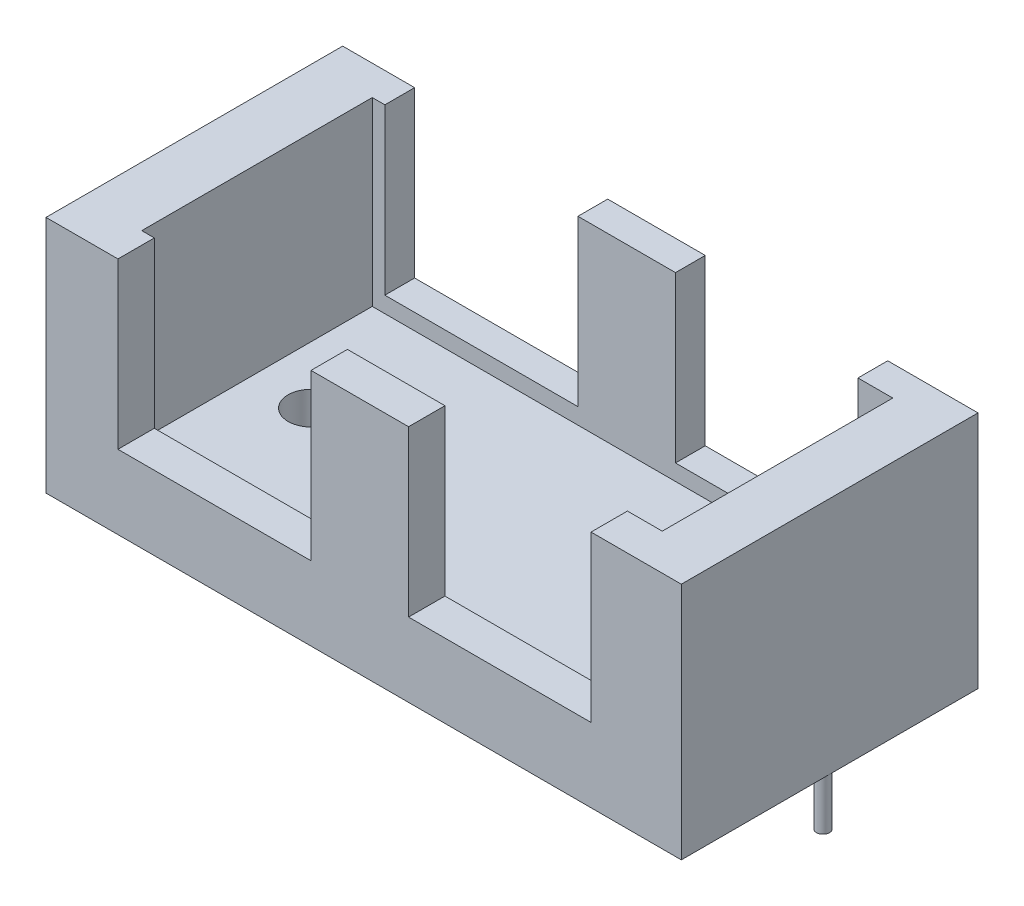
ISO-10303-21;
HEADER;
FILE_DESCRIPTION(('STEP AP214'),'2;1');
FILE_NAME('part.step','',(''),(''),'','','');
FILE_SCHEMA(('AUTOMOTIVE_DESIGN { 1 0 10303 214 1 1 1 1 }'));
ENDSEC;
DATA;
#1=APPLICATION_CONTEXT('core data for automotive mechanical design processes');
#2=APPLICATION_PROTOCOL_DEFINITION('international standard','automotive_design',2000,#1);
#3=PRODUCT_CONTEXT('',#1,'mechanical');
#4=PRODUCT('Part','Part','',(#3));
#5=PRODUCT_RELATED_PRODUCT_CATEGORY('part','',(#4));
#6=PRODUCT_DEFINITION_FORMATION('','',#4);
#7=PRODUCT_DEFINITION_CONTEXT('part definition',#1,'design');
#8=PRODUCT_DEFINITION('design','',#6,#7);
#9=PRODUCT_DEFINITION_SHAPE('','',#8);
#10=(LENGTH_UNIT() NAMED_UNIT(*) SI_UNIT(.MILLI.,.METRE.));
#11=(NAMED_UNIT(*) PLANE_ANGLE_UNIT() SI_UNIT($,.RADIAN.));
#12=(NAMED_UNIT(*) SI_UNIT($,.STERADIAN.) SOLID_ANGLE_UNIT());
#13=UNCERTAINTY_MEASURE_WITH_UNIT(LENGTH_MEASURE(1.E-05),#10,'distance_accuracy_value','');
#14=(GEOMETRIC_REPRESENTATION_CONTEXT(3) GLOBAL_UNCERTAINTY_ASSIGNED_CONTEXT((#13)) GLOBAL_UNIT_ASSIGNED_CONTEXT((#10,
#11,#12)) REPRESENTATION_CONTEXT('',''));
#15=CARTESIAN_POINT('',(0.,0.,0.));
#16=DIRECTION('',(0.,0.,1.));
#17=DIRECTION('',(1.,0.,0.));
#18=AXIS2_PLACEMENT_3D('',#15,#16,#17);
#19=CARTESIAN_POINT('',(0.,16.5,0.));
#20=DIRECTION('',(0.,1.,0.));
#21=DIRECTION('',(0.,0.,1.));
#22=AXIS2_PLACEMENT_3D('',#19,#20,#21);
#23=PLANE('',#22);
#24=DIRECTION('',(0.,0.,-1.));
#25=VECTOR('',#24,1.);
#26=CARTESIAN_POINT('',(14.9871221949098,16.5,0.));
#27=LINE('',#26,#25);
#28=CARTESIAN_POINT('',(14.9871221949098,16.5,11.285141509434));
#29=VERTEX_POINT('',#28);
#30=CARTESIAN_POINT('',(14.9871221949098,16.5,8.77091300304755));
#31=VERTEX_POINT('',#30);
#32=EDGE_CURVE('E278',#29,#31,#27,.T.);
#33=ORIENTED_EDGE('',*,*,#32,.F.);
#34=DIRECTION('',(1.,0.,0.));
#35=VECTOR('',#34,1.);
#36=CARTESIAN_POINT('',(-22.6747641509434,16.5,11.285141509434));
#37=LINE('',#36,#35);
#38=CARTESIAN_POINT('',(21.2252358490566,16.5,11.285141509434));
#39=VERTEX_POINT('',#38);
#40=EDGE_CURVE('E336',#29,#39,#37,.T.);
#41=ORIENTED_EDGE('',*,*,#40,.T.);
#42=DIRECTION('',(0.,0.,-1.));
#43=VECTOR('',#42,1.);
#44=CARTESIAN_POINT('',(21.2252358490566,16.5,-9.21485849056604));
#45=LINE('',#44,#43);
#46=CARTESIAN_POINT('',(21.2252358490566,16.5,-9.21485849056604));
#47=VERTEX_POINT('',#46);
#48=EDGE_CURVE('E341',#39,#47,#45,.T.);
#49=ORIENTED_EDGE('',*,*,#48,.T.);
#50=DIRECTION('',(-1.,0.,0.));
#51=VECTOR('',#50,1.);
#52=CARTESIAN_POINT('',(-22.6747641509434,16.5,-9.21485849056604));
#53=LINE('',#52,#51);
#54=CARTESIAN_POINT('',(14.9871221949098,16.5,-9.21485849056604));
#55=VERTEX_POINT('',#54);
#56=EDGE_CURVE('E345',#47,#55,#53,.T.);
#57=ORIENTED_EDGE('',*,*,#56,.T.);
#58=CARTESIAN_POINT('',(14.9871221949098,16.5,-7.15898780975976));
#59=VERTEX_POINT('',#58);
#60=EDGE_CURVE('E199',#59,#55,#27,.T.);
#61=ORIENTED_EDGE('',*,*,#60,.F.);
#62=DIRECTION('',(-1.,0.,0.));
#63=VECTOR('',#62,1.);
#64=CARTESIAN_POINT('',(17.3921842437679,16.5,-7.15898780975976));
#65=LINE('',#64,#63);
#66=CARTESIAN_POINT('',(17.3921842437679,16.5,-7.15898780975976));
#67=VERTEX_POINT('',#66);
#68=EDGE_CURVE('E301',#67,#59,#65,.T.);
#69=ORIENTED_EDGE('',*,*,#68,.F.);
#70=DIRECTION('',(0.,0.,-1.));
#71=VECTOR('',#70,1.);
#72=CARTESIAN_POINT('',(17.3921842437679,16.5,8.77091300304755));
#73=LINE('',#72,#71);
#74=CARTESIAN_POINT('',(17.3921842437679,16.5,8.77091300304755));
#75=VERTEX_POINT('',#74);
#76=EDGE_CURVE('E284',#75,#67,#73,.T.);
#77=ORIENTED_EDGE('',*,*,#76,.F.);
#78=DIRECTION('',(1.,0.,0.));
#79=VECTOR('',#78,1.);
#80=CARTESIAN_POINT('',(17.3921842437679,16.5,8.77091300304755));
#81=LINE('',#80,#79);
#82=EDGE_CURVE('E308',#31,#75,#81,.T.);
#83=ORIENTED_EDGE('',*,*,#82,.F.);
#84=EDGE_LOOP('',(#33,#41,#49,#57,#61,#69,#77,#83));
#85=FACE_BOUND('',#84,.T.);
#86=ADVANCED_FACE('F32',(#85),#23,.T.);
#87=DIRECTION('',(0.,0.,1.));
#88=VECTOR('',#87,1.);
#89=CARTESIAN_POINT('',(2.37842735237592,16.5,0.));
#90=LINE('',#89,#88);
#91=CARTESIAN_POINT('',(2.37842735237592,16.5,-9.21485849056604));
#92=VERTEX_POINT('',#91);
#93=CARTESIAN_POINT('',(2.37842735237592,16.5,-7.15898780975976));
#94=VERTEX_POINT('',#93);
#95=EDGE_CURVE('E267',#92,#94,#90,.T.);
#96=ORIENTED_EDGE('',*,*,#95,.F.);
#97=CARTESIAN_POINT('',(-4.36227438756731,16.5,-9.21485849056604));
#98=VERTEX_POINT('',#97);
#99=EDGE_CURVE('E348',#92,#98,#53,.T.);
#100=ORIENTED_EDGE('',*,*,#99,.T.);
#101=DIRECTION('',(0.,0.,-1.));
#102=VECTOR('',#101,1.);
#103=CARTESIAN_POINT('',(-4.36227438756731,16.5,0.));
#104=LINE('',#103,#102);
#105=CARTESIAN_POINT('',(-4.36227438756731,16.5,-7.15898780975976));
#106=VERTEX_POINT('',#105);
#107=EDGE_CURVE('E252',#106,#98,#104,.T.);
#108=ORIENTED_EDGE('',*,*,#107,.F.);
#109=EDGE_CURVE('E305',#94,#106,#65,.T.);
#110=ORIENTED_EDGE('',*,*,#109,.F.);
#111=EDGE_LOOP('',(#96,#100,#108,#110));
#112=FACE_BOUND('',#111,.T.);
#113=ADVANCED_FACE('F424',(#112),#23,.T.);
#114=CARTESIAN_POINT('',(2.37842735237592,16.5,8.77091300304755));
#115=VERTEX_POINT('',#114);
#116=CARTESIAN_POINT('',(2.37842735237592,16.5,11.285141509434));
#117=VERTEX_POINT('',#116);
#118=EDGE_CURVE('E270',#115,#117,#90,.T.);
#119=ORIENTED_EDGE('',*,*,#118,.F.);
#120=CARTESIAN_POINT('',(-4.36227438756731,16.5,8.77091300304755));
#121=VERTEX_POINT('',#120);
#122=EDGE_CURVE('E311',#121,#115,#81,.T.);
#123=ORIENTED_EDGE('',*,*,#122,.F.);
#124=CARTESIAN_POINT('',(-4.36227438756731,16.5,11.285141509434));
#125=VERTEX_POINT('',#124);
#126=EDGE_CURVE('E255',#125,#121,#104,.T.);
#127=ORIENTED_EDGE('',*,*,#126,.F.);
#128=EDGE_CURVE('E342',#125,#117,#37,.T.);
#129=ORIENTED_EDGE('',*,*,#128,.T.);
#130=EDGE_LOOP('',(#119,#123,#127,#129));
#131=FACE_BOUND('',#130,.T.);
#132=ADVANCED_FACE('F461',(#131),#23,.T.);
#133=CARTESIAN_POINT('',(-14.5947641509434,6.49999999999999,1.03514150943397));
#134=DIRECTION('',(0.,-1.,0.));
#135=DIRECTION('',(0.,0.,-1.));
#136=AXIS2_PLACEMENT_3D('',#133,#134,#135);
#137=CYLINDRICAL_SURFACE('',#136,1.6);
#138=CARTESIAN_POINT('',(-14.5947641509434,0.,1.03514150943397));
#139=DIRECTION('',(0.,-1.,0.));
#140=DIRECTION('',(0.,0.,-1.));
#141=AXIS2_PLACEMENT_3D('',#138,#139,#140);
#142=CIRCLE('',#141,1.6);
#143=CARTESIAN_POINT('',(-14.5947641509434,0.,-0.564858490566036));
#144=VERTEX_POINT('',#143);
#145=EDGE_CURVE('E326',#144,#144,#142,.T.);
#146=ORIENTED_EDGE('',*,*,#145,.T.);
#147=EDGE_LOOP('',(#146));
#148=FACE_BOUND('',#147,.T.);
#149=CARTESIAN_POINT('',(-14.5947641509434,4.00000000000002,1.03514150943397));
#150=DIRECTION('',(0.,1.,0.));
#151=DIRECTION('',(0.,0.,1.));
#152=AXIS2_PLACEMENT_3D('',#149,#150,#151);
#153=CIRCLE('',#152,1.6);
#154=CARTESIAN_POINT('',(-14.5947641509434,4.00000000000002,2.63514150943397));
#155=VERTEX_POINT('',#154);
#156=EDGE_CURVE('E323',#155,#155,#153,.F.);
#157=ORIENTED_EDGE('',*,*,#156,.F.);
#158=EDGE_LOOP('',(#157));
#159=FACE_BOUND('',#158,.T.);
#160=ADVANCED_FACE('F492',(#148,#159),#137,.F.);
#161=CARTESIAN_POINT('',(13.1452358490566,6.49999999999999,1.03514150943397));
#162=DIRECTION('',(0.,-1.,0.));
#163=DIRECTION('',(0.,0.,-1.));
#164=AXIS2_PLACEMENT_3D('',#161,#162,#163);
#165=CYLINDRICAL_SURFACE('',#164,1.6);
#166=CARTESIAN_POINT('',(13.1452358490566,0.,1.03514150943397));
#167=DIRECTION('',(0.,-1.,0.));
#168=DIRECTION('',(0.,0.,-1.));
#169=AXIS2_PLACEMENT_3D('',#166,#167,#168);
#170=CIRCLE('',#169,1.6);
#171=CARTESIAN_POINT('',(13.1452358490566,0.,-0.564858490566036));
#172=VERTEX_POINT('',#171);
#173=EDGE_CURVE('E327',#172,#172,#170,.T.);
#174=ORIENTED_EDGE('',*,*,#173,.T.);
#175=EDGE_LOOP('',(#174));
#176=FACE_BOUND('',#175,.T.);
#177=CARTESIAN_POINT('',(13.1452358490566,4.00000000000002,1.03514150943397));
#178=DIRECTION('',(0.,1.,0.));
#179=DIRECTION('',(0.,0.,1.));
#180=AXIS2_PLACEMENT_3D('',#177,#178,#179);
#181=CIRCLE('',#180,1.6);
#182=CARTESIAN_POINT('',(13.1452358490566,4.00000000000002,2.63514150943397));
#183=VERTEX_POINT('',#182);
#184=EDGE_CURVE('E315',#183,#183,#181,.F.);
#185=ORIENTED_EDGE('',*,*,#184,.F.);
#186=EDGE_LOOP('',(#185));
#187=FACE_BOUND('',#186,.T.);
#188=ADVANCED_FACE('F496',(#176,#187),#165,.F.);
#189=CARTESIAN_POINT('',(-22.6747641509434,16.5,-9.21485849056604));
#190=DIRECTION('',(1.,0.,0.));
#191=DIRECTION('',(0.,0.,-1.));
#192=AXIS2_PLACEMENT_3D('',#189,#190,#191);
#193=PLANE('',#192);
#194=DIRECTION('',(0.,0.,1.));
#195=VECTOR('',#194,1.);
#196=CARTESIAN_POINT('',(-22.6747641509434,0.,-9.21485849056604));
#197=LINE('',#196,#195);
#198=CARTESIAN_POINT('',(-22.6747641509434,0.,-9.21485849056604));
#199=VERTEX_POINT('',#198);
#200=CARTESIAN_POINT('',(-22.6747641509434,0.,11.285141509434));
#201=VERTEX_POINT('',#200);
#202=EDGE_CURVE('E330',#199,#201,#197,.T.);
#203=ORIENTED_EDGE('',*,*,#202,.T.);
#204=DIRECTION('',(0.,-1.,0.));
#205=VECTOR('',#204,1.);
#206=CARTESIAN_POINT('',(-22.6747641509434,16.5,11.285141509434));
#207=LINE('',#206,#205);
#208=CARTESIAN_POINT('',(-22.6747641509434,16.5,11.285141509434));
#209=VERTEX_POINT('',#208);
#210=EDGE_CURVE('E364',#209,#201,#207,.T.);
#211=ORIENTED_EDGE('',*,*,#210,.F.);
#212=DIRECTION('',(0.,0.,1.));
#213=VECTOR('',#212,1.);
#214=CARTESIAN_POINT('',(-22.6747641509434,16.5,-9.21485849056604));
#215=LINE('',#214,#213);
#216=CARTESIAN_POINT('',(-22.6747641509434,16.5,-9.21485849056604));
#217=VERTEX_POINT('',#216);
#218=EDGE_CURVE('E333',#217,#209,#215,.T.);
#219=ORIENTED_EDGE('',*,*,#218,.F.);
#220=DIRECTION('',(0.,-1.,0.));
#221=VECTOR('',#220,1.);
#222=CARTESIAN_POINT('',(-22.6747641509434,16.5,-9.21485849056604));
#223=LINE('',#222,#221);
#224=EDGE_CURVE('E347',#217,#199,#223,.T.);
#225=ORIENTED_EDGE('',*,*,#224,.T.);
#226=EDGE_LOOP('',(#203,#211,#219,#225));
#227=FACE_BOUND('',#226,.T.);
#228=ADVANCED_FACE('F34',(#227),#193,.F.);
#229=CARTESIAN_POINT('',(-22.6747641509434,16.5,11.285141509434));
#230=DIRECTION('',(0.,0.,-1.));
#231=DIRECTION('',(-1.,0.,0.));
#232=AXIS2_PLACEMENT_3D('',#229,#230,#231);
#233=PLANE('',#232);
#234=ORIENTED_EDGE('',*,*,#40,.F.);
#235=DIRECTION('',(0.,-1.,0.));
#236=VECTOR('',#235,1.);
#237=CARTESIAN_POINT('',(14.9871221949098,16.5,11.285141509434));
#238=LINE('',#237,#236);
#239=CARTESIAN_POINT('',(14.9871221949098,5.1077234264838,11.285141509434));
#240=VERTEX_POINT('',#239);
#241=EDGE_CURVE('E281',#29,#240,#238,.T.);
#242=ORIENTED_EDGE('',*,*,#241,.T.);
#243=DIRECTION('',(-1.,0.,0.));
#244=VECTOR('',#243,1.);
#245=CARTESIAN_POINT('',(-22.6747641509434,5.1077234264838,11.285141509434));
#246=LINE('',#245,#244);
#247=CARTESIAN_POINT('',(2.37842735237592,5.1077234264838,11.285141509434));
#248=VERTEX_POINT('',#247);
#249=EDGE_CURVE('E264',#240,#248,#246,.T.);
#250=ORIENTED_EDGE('',*,*,#249,.T.);
#251=DIRECTION('',(0.,1.,0.));
#252=VECTOR('',#251,1.);
#253=CARTESIAN_POINT('',(2.37842735237592,16.5,11.285141509434));
#254=LINE('',#253,#252);
#255=EDGE_CURVE('E273',#248,#117,#254,.T.);
#256=ORIENTED_EDGE('',*,*,#255,.T.);
#257=ORIENTED_EDGE('',*,*,#128,.F.);
#258=DIRECTION('',(0.,-1.,0.));
#259=VECTOR('',#258,1.);
#260=CARTESIAN_POINT('',(-4.36227438756731,16.5,11.285141509434));
#261=LINE('',#260,#259);
#262=CARTESIAN_POINT('',(-4.36227438756731,5.1077234264838,11.285141509434));
#263=VERTEX_POINT('',#262);
#264=EDGE_CURVE('E258',#125,#263,#261,.T.);
#265=ORIENTED_EDGE('',*,*,#264,.T.);
#266=DIRECTION('',(-1.,0.,0.));
#267=VECTOR('',#266,1.);
#268=CARTESIAN_POINT('',(-22.6747641509434,5.1077234264838,11.285141509434));
#269=LINE('',#268,#267);
#270=CARTESIAN_POINT('',(-17.7031819715054,5.1077234264838,11.285141509434));
#271=VERTEX_POINT('',#270);
#272=EDGE_CURVE('E240',#263,#271,#269,.T.);
#273=ORIENTED_EDGE('',*,*,#272,.T.);
#274=DIRECTION('',(0.,1.,0.));
#275=VECTOR('',#274,1.);
#276=CARTESIAN_POINT('',(-17.7031819715054,16.5,11.285141509434));
#277=LINE('',#276,#275);
#278=CARTESIAN_POINT('',(-17.7031819715054,16.5,11.285141509434));
#279=VERTEX_POINT('',#278);
#280=EDGE_CURVE('E249',#271,#279,#277,.T.);
#281=ORIENTED_EDGE('',*,*,#280,.T.);
#282=EDGE_CURVE('E338',#209,#279,#37,.T.);
#283=ORIENTED_EDGE('',*,*,#282,.F.);
#284=ORIENTED_EDGE('',*,*,#210,.T.);
#285=DIRECTION('',(1.,0.,0.));
#286=VECTOR('',#285,1.);
#287=CARTESIAN_POINT('',(-22.6747641509434,0.,11.285141509434));
#288=LINE('',#287,#286);
#289=CARTESIAN_POINT('',(21.2252358490566,0.,11.285141509434));
#290=VERTEX_POINT('',#289);
#291=EDGE_CURVE('E351',#201,#290,#288,.T.);
#292=ORIENTED_EDGE('',*,*,#291,.T.);
#293=DIRECTION('',(0.,-1.,0.));
#294=VECTOR('',#293,1.);
#295=CARTESIAN_POINT('',(21.2252358490566,16.5,11.285141509434));
#296=LINE('',#295,#294);
#297=EDGE_CURVE('E361',#39,#290,#296,.T.);
#298=ORIENTED_EDGE('',*,*,#297,.F.);
#299=EDGE_LOOP('',(#234,#242,#250,#256,#257,#265,#273,#281,#283,#284,#292,#298));
#300=FACE_BOUND('',#299,.T.);
#301=ADVANCED_FACE('F415',(#300),#233,.F.);
#302=CARTESIAN_POINT('',(21.2252358490566,16.5,-9.21485849056604));
#303=DIRECTION('',(-1.,0.,0.));
#304=DIRECTION('',(0.,0.,1.));
#305=AXIS2_PLACEMENT_3D('',#302,#303,#304);
#306=PLANE('',#305);
#307=DIRECTION('',(0.,0.,-1.));
#308=VECTOR('',#307,1.);
#309=CARTESIAN_POINT('',(21.2252358490566,0.,-9.21485849056604));
#310=LINE('',#309,#308);
#311=CARTESIAN_POINT('',(21.2252358490566,0.,-9.21485849056604));
#312=VERTEX_POINT('',#311);
#313=EDGE_CURVE('E353',#290,#312,#310,.T.);
#314=ORIENTED_EDGE('',*,*,#313,.T.);
#315=DIRECTION('',(0.,-1.,0.));
#316=VECTOR('',#315,1.);
#317=CARTESIAN_POINT('',(21.2252358490566,16.5,-9.21485849056604));
#318=LINE('',#317,#316);
#319=EDGE_CURVE('E358',#47,#312,#318,.T.);
#320=ORIENTED_EDGE('',*,*,#319,.F.);
#321=ORIENTED_EDGE('',*,*,#48,.F.);
#322=ORIENTED_EDGE('',*,*,#297,.T.);
#323=EDGE_LOOP('',(#314,#320,#321,#322));
#324=FACE_BOUND('',#323,.T.);
#325=ADVANCED_FACE('F411',(#324),#306,.F.);
#326=CARTESIAN_POINT('',(-22.6747641509434,16.5,-9.21485849056604));
#327=DIRECTION('',(0.,0.,1.));
#328=DIRECTION('',(1.,0.,0.));
#329=AXIS2_PLACEMENT_3D('',#326,#327,#328);
#330=PLANE('',#329);
#331=DIRECTION('',(-1.,0.,0.));
#332=VECTOR('',#331,1.);
#333=CARTESIAN_POINT('',(14.9871221949098,5.1077234264838,-9.21485849056604));
#334=LINE('',#333,#332);
#335=CARTESIAN_POINT('',(14.9871221949098,5.1077234264838,-9.21485849056604));
#336=VERTEX_POINT('',#335);
#337=CARTESIAN_POINT('',(2.37842735237592,5.1077234264838,-9.21485849056604));
#338=VERTEX_POINT('',#337);
#339=EDGE_CURVE('E204',#336,#338,#334,.T.);
#340=ORIENTED_EDGE('',*,*,#339,.F.);
#341=DIRECTION('',(0.,-1.,0.));
#342=VECTOR('',#341,1.);
#343=CARTESIAN_POINT('',(14.9871221949098,20.75721295558,-9.21485849056604));
#344=LINE('',#343,#342);
#345=EDGE_CURVE('E193',#55,#336,#344,.T.);
#346=ORIENTED_EDGE('',*,*,#345,.F.);
#347=ORIENTED_EDGE('',*,*,#56,.F.);
#348=ORIENTED_EDGE('',*,*,#319,.T.);
#349=DIRECTION('',(-1.,0.,0.));
#350=VECTOR('',#349,1.);
#351=CARTESIAN_POINT('',(-22.6747641509434,0.,-9.21485849056604));
#352=LINE('',#351,#350);
#353=EDGE_CURVE('E337',#312,#199,#352,.T.);
#354=ORIENTED_EDGE('',*,*,#353,.T.);
#355=ORIENTED_EDGE('',*,*,#224,.F.);
#356=CARTESIAN_POINT('',(-17.7031819715054,16.5,-9.21485849056604));
#357=VERTEX_POINT('',#356);
#358=EDGE_CURVE('E344',#357,#217,#53,.T.);
#359=ORIENTED_EDGE('',*,*,#358,.F.);
#360=DIRECTION('',(0.,1.,0.));
#361=VECTOR('',#360,1.);
#362=CARTESIAN_POINT('',(-17.7031819715054,20.75721295558,-9.21485849056604));
#363=LINE('',#362,#361);
#364=CARTESIAN_POINT('',(-17.7031819715054,5.1077234264838,-9.21485849056604));
#365=VERTEX_POINT('',#364);
#366=EDGE_CURVE('E230',#365,#357,#363,.T.);
#367=ORIENTED_EDGE('',*,*,#366,.F.);
#368=DIRECTION('',(-1.,0.,0.));
#369=VECTOR('',#368,1.);
#370=CARTESIAN_POINT('',(-4.36227438756731,5.1077234264838,-9.21485849056604));
#371=LINE('',#370,#369);
#372=CARTESIAN_POINT('',(-4.36227438756731,5.1077234264838,-9.21485849056604));
#373=VERTEX_POINT('',#372);
#374=EDGE_CURVE('E226',#373,#365,#371,.T.);
#375=ORIENTED_EDGE('',*,*,#374,.F.);
#376=DIRECTION('',(0.,-1.,0.));
#377=VECTOR('',#376,1.);
#378=CARTESIAN_POINT('',(-4.36227438756731,20.75721295558,-9.21485849056604));
#379=LINE('',#378,#377);
#380=EDGE_CURVE('E224',#98,#373,#379,.T.);
#381=ORIENTED_EDGE('',*,*,#380,.F.);
#382=ORIENTED_EDGE('',*,*,#99,.F.);
#383=DIRECTION('',(0.,1.,0.));
#384=VECTOR('',#383,1.);
#385=CARTESIAN_POINT('',(2.37842735237592,20.75721295558,-9.21485849056604));
#386=LINE('',#385,#384);
#387=EDGE_CURVE('E213',#338,#92,#386,.T.);
#388=ORIENTED_EDGE('',*,*,#387,.F.);
#389=EDGE_LOOP('',(#340,#346,#347,#348,#354,#355,#359,#367,#375,#381,#382,#388));
#390=FACE_BOUND('',#389,.T.);
#391=ADVANCED_FACE('F215',(#390),#330,.F.);
#392=DIRECTION('',(0.,0.,1.));
#393=VECTOR('',#392,1.);
#394=CARTESIAN_POINT('',(-17.7031819715054,16.5,0.));
#395=LINE('',#394,#393);
#396=CARTESIAN_POINT('',(-17.7031819715054,16.5,-7.15898780975976));
#397=VERTEX_POINT('',#396);
#398=EDGE_CURVE('E243',#357,#397,#395,.T.);
#399=ORIENTED_EDGE('',*,*,#398,.F.);
#400=ORIENTED_EDGE('',*,*,#358,.T.);
#401=ORIENTED_EDGE('',*,*,#218,.T.);
#402=ORIENTED_EDGE('',*,*,#282,.T.);
#403=CARTESIAN_POINT('',(-17.7031819715054,16.5,8.77091300304755));
#404=VERTEX_POINT('',#403);
#405=EDGE_CURVE('E246',#404,#279,#395,.T.);
#406=ORIENTED_EDGE('',*,*,#405,.F.);
#407=CARTESIAN_POINT('',(-18.5742760659622,16.5,8.77091300304755));
#408=VERTEX_POINT('',#407);
#409=EDGE_CURVE('E289',#408,#404,#81,.T.);
#410=ORIENTED_EDGE('',*,*,#409,.F.);
#411=DIRECTION('',(0.,0.,1.));
#412=VECTOR('',#411,1.);
#413=CARTESIAN_POINT('',(-18.5742760659622,16.5,8.77091300304755));
#414=LINE('',#413,#412);
#415=CARTESIAN_POINT('',(-18.5742760659622,16.5,-7.15898780975976));
#416=VERTEX_POINT('',#415);
#417=EDGE_CURVE('E304',#416,#408,#414,.T.);
#418=ORIENTED_EDGE('',*,*,#417,.F.);
#419=EDGE_CURVE('E300',#397,#416,#65,.T.);
#420=ORIENTED_EDGE('',*,*,#419,.F.);
#421=EDGE_LOOP('',(#399,#400,#401,#402,#406,#410,#418,#420));
#422=FACE_BOUND('',#421,.T.);
#423=ADVANCED_FACE('F392',(#422),#23,.T.);
#424=CARTESIAN_POINT('',(0.,0.,0.));
#425=DIRECTION('',(0.,1.,0.));
#426=DIRECTION('',(0.,0.,1.));
#427=AXIS2_PLACEMENT_3D('',#424,#425,#426);
#428=PLANE('',#427);
#429=CARTESIAN_POINT('',(-22.2147641509434,0.,1.03514150943397));
#430=DIRECTION('',(0.,1.,0.));
#431=DIRECTION('',(0.,0.,1.));
#432=AXIS2_PLACEMENT_3D('',#429,#430,#431);
#433=CIRCLE('',#432,0.449999999999998);
#434=CARTESIAN_POINT('',(-22.2147641509434,0.,1.48514150943396));
#435=VERTEX_POINT('',#434);
#436=EDGE_CURVE('E11',#435,#435,#433,.F.);
#437=ORIENTED_EDGE('',*,*,#436,.F.);
#438=EDGE_LOOP('',(#437));
#439=FACE_BOUND('',#438,.T.);
#440=CARTESIAN_POINT('',(20.7652358490566,0.,1.03514150943397));
#441=DIRECTION('',(0.,1.,0.));
#442=DIRECTION('',(0.,0.,1.));
#443=AXIS2_PLACEMENT_3D('',#440,#441,#442);
#444=CIRCLE('',#443,0.449999999999998);
#445=CARTESIAN_POINT('',(20.7652358490566,0.,1.48514150943396));
#446=VERTEX_POINT('',#445);
#447=EDGE_CURVE('E40',#446,#446,#444,.F.);
#448=ORIENTED_EDGE('',*,*,#447,.F.);
#449=EDGE_LOOP('',(#448));
#450=FACE_BOUND('',#449,.T.);
#451=ORIENTED_EDGE('',*,*,#173,.F.);
#452=EDGE_LOOP('',(#451));
#453=FACE_BOUND('',#452,.T.);
#454=ORIENTED_EDGE('',*,*,#145,.F.);
#455=EDGE_LOOP('',(#454));
#456=FACE_BOUND('',#455,.T.);
#457=ORIENTED_EDGE('',*,*,#202,.F.);
#458=ORIENTED_EDGE('',*,*,#353,.F.);
#459=ORIENTED_EDGE('',*,*,#313,.F.);
#460=ORIENTED_EDGE('',*,*,#291,.F.);
#461=EDGE_LOOP('',(#457,#458,#459,#460));
#462=FACE_BOUND('',#461,.T.);
#463=ADVANCED_FACE('F388',(#439,#450,#453,#456,#462),#428,.F.);
#464=CARTESIAN_POINT('',(0.,4.00000000000002,0.));
#465=DIRECTION('',(0.,1.,0.));
#466=DIRECTION('',(0.,0.,1.));
#467=AXIS2_PLACEMENT_3D('',#464,#465,#466);
#468=PLANE('',#467);
#469=DIRECTION('',(0.,0.,-1.));
#470=VECTOR('',#469,1.);
#471=CARTESIAN_POINT('',(17.3921842437679,4.00000000000002,8.77091300304755));
#472=LINE('',#471,#470);
#473=CARTESIAN_POINT('',(17.3921842437679,4.00000000000002,8.77091300304755));
#474=VERTEX_POINT('',#473);
#475=CARTESIAN_POINT('',(17.3921842437679,4.00000000000002,-7.15898780975976));
#476=VERTEX_POINT('',#475);
#477=EDGE_CURVE('E285',#474,#476,#472,.T.);
#478=ORIENTED_EDGE('',*,*,#477,.T.);
#479=DIRECTION('',(-1.,0.,0.));
#480=VECTOR('',#479,1.);
#481=CARTESIAN_POINT('',(17.3921842437679,4.00000000000002,-7.15898780975976));
#482=LINE('',#481,#480);
#483=CARTESIAN_POINT('',(-18.5742760659622,4.00000000000002,-7.15898780975976));
#484=VERTEX_POINT('',#483);
#485=EDGE_CURVE('E288',#476,#484,#482,.T.);
#486=ORIENTED_EDGE('',*,*,#485,.T.);
#487=DIRECTION('',(0.,0.,1.));
#488=VECTOR('',#487,1.);
#489=CARTESIAN_POINT('',(-18.5742760659622,4.00000000000002,8.77091300304755));
#490=LINE('',#489,#488);
#491=CARTESIAN_POINT('',(-18.5742760659622,4.00000000000002,8.77091300304755));
#492=VERTEX_POINT('',#491);
#493=EDGE_CURVE('E292',#484,#492,#490,.T.);
#494=ORIENTED_EDGE('',*,*,#493,.T.);
#495=DIRECTION('',(1.,0.,0.));
#496=VECTOR('',#495,1.);
#497=CARTESIAN_POINT('',(17.3921842437679,4.00000000000002,8.77091300304755));
#498=LINE('',#497,#496);
#499=EDGE_CURVE('E295',#492,#474,#498,.T.);
#500=ORIENTED_EDGE('',*,*,#499,.T.);
#501=EDGE_LOOP('',(#478,#486,#494,#500));
#502=FACE_BOUND('',#501,.T.);
#503=ORIENTED_EDGE('',*,*,#184,.T.);
#504=EDGE_LOOP('',(#503));
#505=FACE_BOUND('',#504,.T.);
#506=ORIENTED_EDGE('',*,*,#156,.T.);
#507=EDGE_LOOP('',(#506));
#508=FACE_BOUND('',#507,.T.);
#509=ADVANCED_FACE('F391',(#502,#505,#508),#468,.T.);
#510=CARTESIAN_POINT('',(17.3921842437679,4.00000000000002,8.77091300304755));
#511=DIRECTION('',(1.,0.,0.));
#512=DIRECTION('',(0.,0.,-1.));
#513=AXIS2_PLACEMENT_3D('',#510,#511,#512);
#514=PLANE('',#513);
#515=ORIENTED_EDGE('',*,*,#76,.T.);
#516=DIRECTION('',(0.,1.,0.));
#517=VECTOR('',#516,1.);
#518=CARTESIAN_POINT('',(17.3921842437679,4.00000000000002,-7.15898780975976));
#519=LINE('',#518,#517);
#520=EDGE_CURVE('E298',#476,#67,#519,.T.);
#521=ORIENTED_EDGE('',*,*,#520,.F.);
#522=ORIENTED_EDGE('',*,*,#477,.F.);
#523=DIRECTION('',(0.,1.,0.));
#524=VECTOR('',#523,1.);
#525=CARTESIAN_POINT('',(17.3921842437679,4.00000000000002,8.77091300304755));
#526=LINE('',#525,#524);
#527=EDGE_CURVE('E312',#474,#75,#526,.T.);
#528=ORIENTED_EDGE('',*,*,#527,.T.);
#529=EDGE_LOOP('',(#515,#521,#522,#528));
#530=FACE_BOUND('',#529,.T.);
#531=ADVANCED_FACE('F469',(#530),#514,.F.);
#532=CARTESIAN_POINT('',(17.3921842437679,4.00000000000002,8.77091300304755));
#533=DIRECTION('',(0.,0.,1.));
#534=DIRECTION('',(1.,0.,0.));
#535=AXIS2_PLACEMENT_3D('',#532,#533,#534);
#536=PLANE('',#535);
#537=DIRECTION('',(1.,0.,0.));
#538=VECTOR('',#537,1.);
#539=CARTESIAN_POINT('',(17.3921842437679,5.1077234264838,8.77091300304755));
#540=LINE('',#539,#538);
#541=CARTESIAN_POINT('',(2.37842735237592,5.1077234264838,8.77091300304756));
#542=VERTEX_POINT('',#541);
#543=CARTESIAN_POINT('',(14.9871221949098,5.1077234264838,8.77091300304755));
#544=VERTEX_POINT('',#543);
#545=EDGE_CURVE('E261',#542,#544,#540,.T.);
#546=ORIENTED_EDGE('',*,*,#545,.T.);
#547=DIRECTION('',(0.,1.,0.));
#548=VECTOR('',#547,1.);
#549=CARTESIAN_POINT('',(14.9871221949098,4.00000000000002,8.77091300304755));
#550=LINE('',#549,#548);
#551=EDGE_CURVE('E277',#544,#31,#550,.T.);
#552=ORIENTED_EDGE('',*,*,#551,.T.);
#553=ORIENTED_EDGE('',*,*,#82,.T.);
#554=ORIENTED_EDGE('',*,*,#527,.F.);
#555=ORIENTED_EDGE('',*,*,#499,.F.);
#556=DIRECTION('',(0.,1.,0.));
#557=VECTOR('',#556,1.);
#558=CARTESIAN_POINT('',(-18.5742760659622,4.00000000000002,8.77091300304755));
#559=LINE('',#558,#557);
#560=EDGE_CURVE('E316',#492,#408,#559,.T.);
#561=ORIENTED_EDGE('',*,*,#560,.T.);
#562=ORIENTED_EDGE('',*,*,#409,.T.);
#563=DIRECTION('',(0.,-1.,0.));
#564=VECTOR('',#563,1.);
#565=CARTESIAN_POINT('',(-17.7031819715054,4.00000000000002,8.77091300304755));
#566=LINE('',#565,#564);
#567=CARTESIAN_POINT('',(-17.7031819715054,5.1077234264838,8.77091300304756));
#568=VERTEX_POINT('',#567);
#569=EDGE_CURVE('E245',#404,#568,#566,.T.);
#570=ORIENTED_EDGE('',*,*,#569,.T.);
#571=DIRECTION('',(1.,0.,0.));
#572=VECTOR('',#571,1.);
#573=CARTESIAN_POINT('',(17.3921842437679,5.1077234264838,8.77091300304755));
#574=LINE('',#573,#572);
#575=CARTESIAN_POINT('',(-4.36227438756731,5.1077234264838,8.77091300304755));
#576=VERTEX_POINT('',#575);
#577=EDGE_CURVE('E237',#568,#576,#574,.T.);
#578=ORIENTED_EDGE('',*,*,#577,.T.);
#579=DIRECTION('',(0.,1.,0.));
#580=VECTOR('',#579,1.);
#581=CARTESIAN_POINT('',(-4.36227438756731,4.00000000000002,8.77091300304755));
#582=LINE('',#581,#580);
#583=EDGE_CURVE('E254',#576,#121,#582,.T.);
#584=ORIENTED_EDGE('',*,*,#583,.T.);
#585=ORIENTED_EDGE('',*,*,#122,.T.);
#586=DIRECTION('',(0.,-1.,0.));
#587=VECTOR('',#586,1.);
#588=CARTESIAN_POINT('',(2.37842735237592,4.00000000000002,8.77091300304755));
#589=LINE('',#588,#587);
#590=EDGE_CURVE('E269',#115,#542,#589,.T.);
#591=ORIENTED_EDGE('',*,*,#590,.T.);
#592=EDGE_LOOP('',(#546,#552,#553,#554,#555,#561,#562,#570,#578,#584,#585,#591));
#593=FACE_BOUND('',#592,.T.);
#594=ADVANCED_FACE('F445',(#593),#536,.F.);
#595=CARTESIAN_POINT('',(-18.5742760659622,4.00000000000002,8.77091300304755));
#596=DIRECTION('',(-1.,0.,0.));
#597=DIRECTION('',(0.,0.,1.));
#598=AXIS2_PLACEMENT_3D('',#595,#596,#597);
#599=PLANE('',#598);
#600=ORIENTED_EDGE('',*,*,#417,.T.);
#601=ORIENTED_EDGE('',*,*,#560,.F.);
#602=ORIENTED_EDGE('',*,*,#493,.F.);
#603=DIRECTION('',(0.,1.,0.));
#604=VECTOR('',#603,1.);
#605=CARTESIAN_POINT('',(-18.5742760659622,4.00000000000002,-7.15898780975976));
#606=LINE('',#605,#604);
#607=EDGE_CURVE('E318',#484,#416,#606,.T.);
#608=ORIENTED_EDGE('',*,*,#607,.T.);
#609=EDGE_LOOP('',(#600,#601,#602,#608));
#610=FACE_BOUND('',#609,.T.);
#611=ADVANCED_FACE('F442',(#610),#599,.F.);
#612=CARTESIAN_POINT('',(17.3921842437679,4.00000000000002,-7.15898780975976));
#613=DIRECTION('',(0.,0.,-1.));
#614=DIRECTION('',(-1.,0.,0.));
#615=AXIS2_PLACEMENT_3D('',#612,#613,#614);
#616=PLANE('',#615);
#617=ORIENTED_EDGE('',*,*,#68,.T.);
#618=DIRECTION('',(0.,-1.,0.));
#619=VECTOR('',#618,1.);
#620=CARTESIAN_POINT('',(14.9871221949098,4.00000000000002,-7.15898780975976));
#621=LINE('',#620,#619);
#622=CARTESIAN_POINT('',(14.9871221949098,5.1077234264838,-7.15898780975976));
#623=VERTEX_POINT('',#622);
#624=EDGE_CURVE('E382',#59,#623,#621,.T.);
#625=ORIENTED_EDGE('',*,*,#624,.T.);
#626=DIRECTION('',(-1.,0.,0.));
#627=VECTOR('',#626,1.);
#628=CARTESIAN_POINT('',(17.3921842437679,5.1077234264838,-7.15898780975976));
#629=LINE('',#628,#627);
#630=CARTESIAN_POINT('',(2.37842735237592,5.1077234264838,-7.15898780975976));
#631=VERTEX_POINT('',#630);
#632=EDGE_CURVE('E212',#623,#631,#629,.T.);
#633=ORIENTED_EDGE('',*,*,#632,.T.);
#634=DIRECTION('',(0.,1.,0.));
#635=VECTOR('',#634,1.);
#636=CARTESIAN_POINT('',(2.37842735237592,4.00000000000002,-7.15898780975976));
#637=LINE('',#636,#635);
#638=EDGE_CURVE('E379',#631,#94,#637,.T.);
#639=ORIENTED_EDGE('',*,*,#638,.T.);
#640=ORIENTED_EDGE('',*,*,#109,.T.);
#641=DIRECTION('',(0.,-1.,0.));
#642=VECTOR('',#641,1.);
#643=CARTESIAN_POINT('',(-4.36227438756731,4.00000000000002,-7.15898780975976));
#644=LINE('',#643,#642);
#645=CARTESIAN_POINT('',(-4.36227438756731,5.1077234264838,-7.15898780975976));
#646=VERTEX_POINT('',#645);
#647=EDGE_CURVE('E375',#106,#646,#644,.T.);
#648=ORIENTED_EDGE('',*,*,#647,.T.);
#649=DIRECTION('',(-1.,0.,0.));
#650=VECTOR('',#649,1.);
#651=CARTESIAN_POINT('',(17.3921842437679,5.1077234264838,-7.15898780975976));
#652=LINE('',#651,#650);
#653=CARTESIAN_POINT('',(-17.7031819715054,5.1077234264838,-7.15898780975976));
#654=VERTEX_POINT('',#653);
#655=EDGE_CURVE('E367',#646,#654,#652,.T.);
#656=ORIENTED_EDGE('',*,*,#655,.T.);
#657=DIRECTION('',(0.,1.,0.));
#658=VECTOR('',#657,1.);
#659=CARTESIAN_POINT('',(-17.7031819715054,4.00000000000002,-7.15898780975976));
#660=LINE('',#659,#658);
#661=EDGE_CURVE('E372',#654,#397,#660,.T.);
#662=ORIENTED_EDGE('',*,*,#661,.T.);
#663=ORIENTED_EDGE('',*,*,#419,.T.);
#664=ORIENTED_EDGE('',*,*,#607,.F.);
#665=ORIENTED_EDGE('',*,*,#485,.F.);
#666=ORIENTED_EDGE('',*,*,#520,.T.);
#667=EDGE_LOOP('',(#617,#625,#633,#639,#640,#648,#656,#662,#663,#664,#665,#666));
#668=FACE_BOUND('',#667,.T.);
#669=ADVANCED_FACE('F436',(#668),#616,.F.);
#670=CARTESIAN_POINT('',(-4.36227438756731,5.1077234264838,19.285141509434));
#671=DIRECTION('',(0.,-1.,0.));
#672=DIRECTION('',(0.,0.,-1.));
#673=AXIS2_PLACEMENT_3D('',#670,#671,#672);
#674=PLANE('',#673);
#675=DIRECTION('',(0.,0.,-1.));
#676=VECTOR('',#675,1.);
#677=CARTESIAN_POINT('',(-4.36227438756731,5.1077234264838,19.285141509434));
#678=LINE('',#677,#676);
#679=EDGE_CURVE('E232',#646,#373,#678,.T.);
#680=ORIENTED_EDGE('',*,*,#679,.T.);
#681=ORIENTED_EDGE('',*,*,#374,.T.);
#682=DIRECTION('',(0.,0.,-1.));
#683=VECTOR('',#682,1.);
#684=CARTESIAN_POINT('',(-17.7031819715054,5.1077234264838,19.285141509434));
#685=LINE('',#684,#683);
#686=EDGE_CURVE('E233',#654,#365,#685,.T.);
#687=ORIENTED_EDGE('',*,*,#686,.F.);
#688=ORIENTED_EDGE('',*,*,#655,.F.);
#689=EDGE_LOOP('',(#680,#681,#687,#688));
#690=FACE_BOUND('',#689,.T.);
#691=ADVANCED_FACE('F433',(#690),#674,.F.);
#692=CARTESIAN_POINT('',(-17.7031819715054,20.75721295558,19.285141509434));
#693=DIRECTION('',(-1.,0.,0.));
#694=DIRECTION('',(0.,0.,1.));
#695=AXIS2_PLACEMENT_3D('',#692,#693,#694);
#696=PLANE('',#695);
#697=ORIENTED_EDGE('',*,*,#398,.T.);
#698=ORIENTED_EDGE('',*,*,#661,.F.);
#699=ORIENTED_EDGE('',*,*,#686,.T.);
#700=ORIENTED_EDGE('',*,*,#366,.T.);
#701=EDGE_LOOP('',(#697,#698,#699,#700));
#702=FACE_BOUND('',#701,.T.);
#703=ADVANCED_FACE('F556',(#702),#696,.F.);
#704=CARTESIAN_POINT('',(-4.36227438756731,20.75721295558,19.285141509434));
#705=DIRECTION('',(1.,0.,0.));
#706=DIRECTION('',(0.,0.,-1.));
#707=AXIS2_PLACEMENT_3D('',#704,#705,#706);
#708=PLANE('',#707);
#709=ORIENTED_EDGE('',*,*,#107,.T.);
#710=ORIENTED_EDGE('',*,*,#380,.T.);
#711=ORIENTED_EDGE('',*,*,#679,.F.);
#712=ORIENTED_EDGE('',*,*,#647,.F.);
#713=EDGE_LOOP('',(#709,#710,#711,#712));
#714=FACE_BOUND('',#713,.T.);
#715=ADVANCED_FACE('F431',(#714),#708,.F.);
#716=CARTESIAN_POINT('',(14.9871221949098,5.1077234264838,19.285141509434));
#717=DIRECTION('',(0.,-1.,0.));
#718=DIRECTION('',(0.,0.,-1.));
#719=AXIS2_PLACEMENT_3D('',#716,#717,#718);
#720=PLANE('',#719);
#721=DIRECTION('',(0.,0.,-1.));
#722=VECTOR('',#721,1.);
#723=CARTESIAN_POINT('',(14.9871221949098,5.1077234264838,19.285141509434));
#724=LINE('',#723,#722);
#725=EDGE_CURVE('E196',#623,#336,#724,.T.);
#726=ORIENTED_EDGE('',*,*,#725,.T.);
#727=ORIENTED_EDGE('',*,*,#339,.T.);
#728=DIRECTION('',(0.,0.,-1.));
#729=VECTOR('',#728,1.);
#730=CARTESIAN_POINT('',(2.37842735237592,5.1077234264838,19.285141509434));
#731=LINE('',#730,#729);
#732=EDGE_CURVE('E221',#631,#338,#731,.T.);
#733=ORIENTED_EDGE('',*,*,#732,.F.);
#734=ORIENTED_EDGE('',*,*,#632,.F.);
#735=EDGE_LOOP('',(#726,#727,#733,#734));
#736=FACE_BOUND('',#735,.T.);
#737=ADVANCED_FACE('F209',(#736),#720,.F.);
#738=CARTESIAN_POINT('',(2.37842735237592,20.75721295558,19.285141509434));
#739=DIRECTION('',(-1.,0.,0.));
#740=DIRECTION('',(0.,0.,1.));
#741=AXIS2_PLACEMENT_3D('',#738,#739,#740);
#742=PLANE('',#741);
#743=ORIENTED_EDGE('',*,*,#95,.T.);
#744=ORIENTED_EDGE('',*,*,#638,.F.);
#745=ORIENTED_EDGE('',*,*,#732,.T.);
#746=ORIENTED_EDGE('',*,*,#387,.T.);
#747=EDGE_LOOP('',(#743,#744,#745,#746));
#748=FACE_BOUND('',#747,.T.);
#749=ADVANCED_FACE('F586',(#748),#742,.F.);
#750=CARTESIAN_POINT('',(14.9871221949098,20.75721295558,19.285141509434));
#751=DIRECTION('',(1.,0.,0.));
#752=DIRECTION('',(0.,0.,-1.));
#753=AXIS2_PLACEMENT_3D('',#750,#751,#752);
#754=PLANE('',#753);
#755=ORIENTED_EDGE('',*,*,#60,.T.);
#756=ORIENTED_EDGE('',*,*,#345,.T.);
#757=ORIENTED_EDGE('',*,*,#725,.F.);
#758=ORIENTED_EDGE('',*,*,#624,.F.);
#759=EDGE_LOOP('',(#755,#756,#757,#758));
#760=FACE_BOUND('',#759,.T.);
#761=ADVANCED_FACE('F195',(#760),#754,.F.);
#762=ORIENTED_EDGE('',*,*,#126,.T.);
#763=ORIENTED_EDGE('',*,*,#583,.F.);
#764=EDGE_CURVE('E55',#263,#576,#678,.T.);
#765=ORIENTED_EDGE('',*,*,#764,.F.);
#766=ORIENTED_EDGE('',*,*,#264,.F.);
#767=EDGE_LOOP('',(#762,#763,#765,#766));
#768=FACE_BOUND('',#767,.T.);
#769=ADVANCED_FACE('F578',(#768),#708,.F.);
#770=EDGE_CURVE('E205',#271,#568,#685,.T.);
#771=ORIENTED_EDGE('',*,*,#770,.T.);
#772=ORIENTED_EDGE('',*,*,#569,.F.);
#773=ORIENTED_EDGE('',*,*,#405,.T.);
#774=ORIENTED_EDGE('',*,*,#280,.F.);
#775=EDGE_LOOP('',(#771,#772,#773,#774));
#776=FACE_BOUND('',#775,.T.);
#777=ADVANCED_FACE('F569',(#776),#696,.F.);
#778=ORIENTED_EDGE('',*,*,#764,.T.);
#779=ORIENTED_EDGE('',*,*,#577,.F.);
#780=ORIENTED_EDGE('',*,*,#770,.F.);
#781=ORIENTED_EDGE('',*,*,#272,.F.);
#782=EDGE_LOOP('',(#778,#779,#780,#781));
#783=FACE_BOUND('',#782,.T.);
#784=ADVANCED_FACE('F558',(#783),#674,.F.);
#785=ORIENTED_EDGE('',*,*,#32,.T.);
#786=ORIENTED_EDGE('',*,*,#551,.F.);
#787=EDGE_CURVE('E47',#240,#544,#724,.T.);
#788=ORIENTED_EDGE('',*,*,#787,.F.);
#789=ORIENTED_EDGE('',*,*,#241,.F.);
#790=EDGE_LOOP('',(#785,#786,#788,#789));
#791=FACE_BOUND('',#790,.T.);
#792=ADVANCED_FACE('F605',(#791),#754,.F.);
#793=EDGE_CURVE('E222',#248,#542,#731,.T.);
#794=ORIENTED_EDGE('',*,*,#793,.T.);
#795=ORIENTED_EDGE('',*,*,#590,.F.);
#796=ORIENTED_EDGE('',*,*,#118,.T.);
#797=ORIENTED_EDGE('',*,*,#255,.F.);
#798=EDGE_LOOP('',(#794,#795,#796,#797));
#799=FACE_BOUND('',#798,.T.);
#800=ADVANCED_FACE('F467',(#799),#742,.F.);
#801=ORIENTED_EDGE('',*,*,#787,.T.);
#802=ORIENTED_EDGE('',*,*,#545,.F.);
#803=ORIENTED_EDGE('',*,*,#793,.F.);
#804=ORIENTED_EDGE('',*,*,#249,.F.);
#805=EDGE_LOOP('',(#801,#802,#803,#804));
#806=FACE_BOUND('',#805,.T.);
#807=ADVANCED_FACE('F468',(#806),#720,.F.);
#808=CARTESIAN_POINT('',(20.7652358490566,-3.49999999999998,1.03514150943397));
#809=DIRECTION('',(0.,1.,0.));
#810=DIRECTION('',(0.,0.,1.));
#811=AXIS2_PLACEMENT_3D('',#808,#809,#810);
#812=CYLINDRICAL_SURFACE('',#811,0.449999999999998);
#813=CARTESIAN_POINT('',(20.7652358490566,-3.49999999999998,1.03514150943397));
#814=DIRECTION('',(0.,-1.,0.));
#815=DIRECTION('',(0.,0.,-1.));
#816=AXIS2_PLACEMENT_3D('',#813,#814,#815);
#817=CIRCLE('',#816,0.449999999999998);
#818=CARTESIAN_POINT('',(20.7652358490566,-3.49999999999998,0.585141509433967));
#819=VERTEX_POINT('',#818);
#820=EDGE_CURVE('E227',#819,#819,#817,.T.);
#821=ORIENTED_EDGE('',*,*,#820,.F.);
#822=EDGE_LOOP('',(#821));
#823=FACE_BOUND('',#822,.T.);
#824=ORIENTED_EDGE('',*,*,#447,.T.);
#825=EDGE_LOOP('',(#824));
#826=FACE_BOUND('',#825,.T.);
#827=ADVANCED_FACE('F386',(#823,#826),#812,.T.);
#828=CARTESIAN_POINT('',(20.7652358490566,-3.49999999999998,1.03514150943397));
#829=DIRECTION('',(0.,-1.,0.));
#830=DIRECTION('',(0.,0.,-1.));
#831=AXIS2_PLACEMENT_3D('',#828,#829,#830);
#832=PLANE('',#831);
#833=ORIENTED_EDGE('',*,*,#820,.T.);
#834=EDGE_LOOP('',(#833));
#835=FACE_BOUND('',#834,.T.);
#836=ADVANCED_FACE('F664',(#835),#832,.T.);
#837=CARTESIAN_POINT('',(-22.2147641509434,-3.49999999999998,1.03514150943397));
#838=DIRECTION('',(0.,1.,0.));
#839=DIRECTION('',(0.,0.,1.));
#840=AXIS2_PLACEMENT_3D('',#837,#838,#839);
#841=CYLINDRICAL_SURFACE('',#840,0.449999999999998);
#842=CARTESIAN_POINT('',(-22.2147641509434,-3.49999999999998,1.03514150943397));
#843=DIRECTION('',(0.,-1.,0.));
#844=DIRECTION('',(0.,0.,-1.));
#845=AXIS2_PLACEMENT_3D('',#842,#843,#844);
#846=CIRCLE('',#845,0.449999999999998);
#847=CARTESIAN_POINT('',(-22.2147641509434,-3.49999999999998,0.585141509433967));
#848=VERTEX_POINT('',#847);
#849=EDGE_CURVE('E734',#848,#848,#846,.T.);
#850=ORIENTED_EDGE('',*,*,#849,.F.);
#851=EDGE_LOOP('',(#850));
#852=FACE_BOUND('',#851,.T.);
#853=ORIENTED_EDGE('',*,*,#436,.T.);
#854=EDGE_LOOP('',(#853));
#855=FACE_BOUND('',#854,.T.);
#856=ADVANCED_FACE('F674',(#852,#855),#841,.T.);
#857=CARTESIAN_POINT('',(-22.2147641509434,-3.49999999999998,1.03514150943397));
#858=DIRECTION('',(0.,-1.,0.));
#859=DIRECTION('',(0.,0.,-1.));
#860=AXIS2_PLACEMENT_3D('',#857,#858,#859);
#861=PLANE('',#860);
#862=ORIENTED_EDGE('',*,*,#849,.T.);
#863=EDGE_LOOP('',(#862));
#864=FACE_BOUND('',#863,.T.);
#865=ADVANCED_FACE('F684',(#864),#861,.T.);
#866=CLOSED_SHELL('',(#86,#113,#132,#160,#188,#228,#301,#325,#391,#423,#463,#509,#531,#594,#611,
#669,#691,#703,#715,#737,#749,#761,#769,#777,#784,#792,#800,#807,#827,#836,#856,#865));
#867=MANIFOLD_SOLID_BREP('B2',#866);
#868=ADVANCED_BREP_SHAPE_REPRESENTATION('',(#18,#867),#14);
#869=SHAPE_DEFINITION_REPRESENTATION(#9,#868);
ENDSEC;
END-ISO-10303-21;
